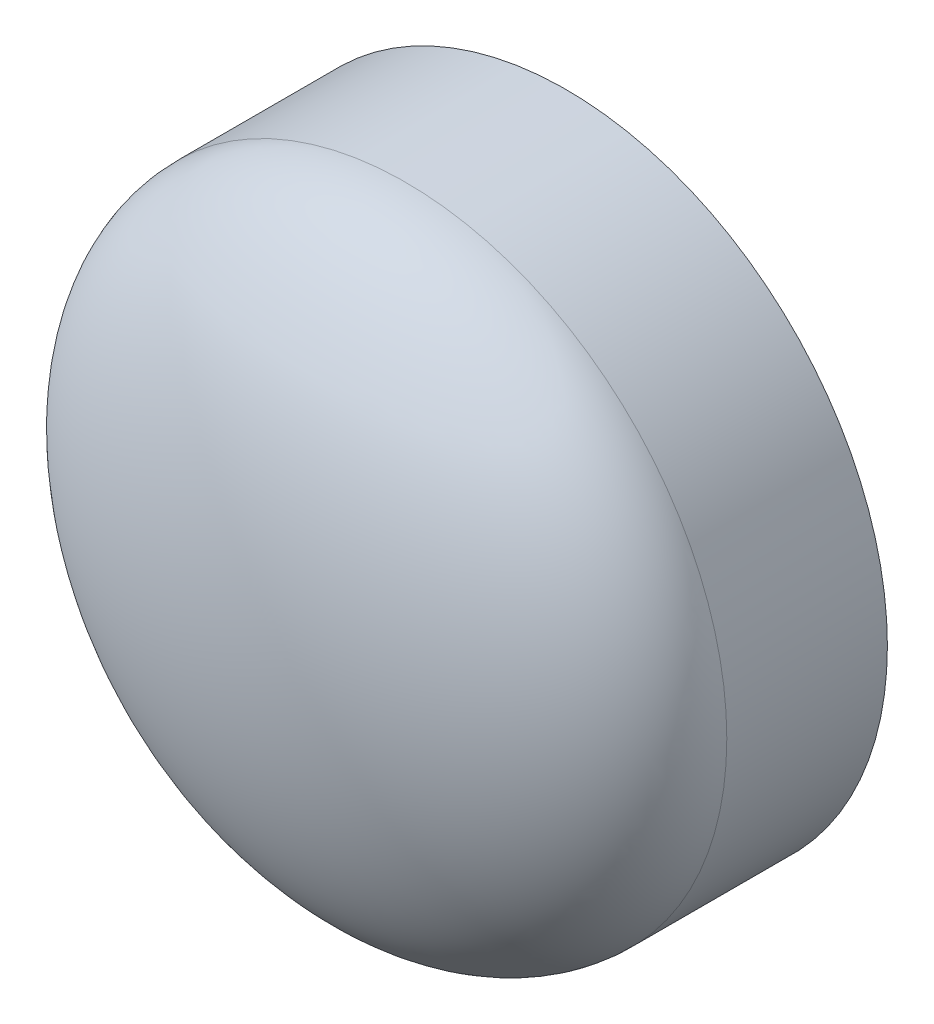
ISO-10303-21;
HEADER;
FILE_DESCRIPTION(('STEP AP214'),'2;1');
FILE_NAME('part.step','',(''),(''),'','','');
FILE_SCHEMA(('AUTOMOTIVE_DESIGN { 1 0 10303 214 1 1 1 1 }'));
ENDSEC;
DATA;
#1=APPLICATION_CONTEXT('core data for automotive mechanical design processes');
#2=APPLICATION_PROTOCOL_DEFINITION('international standard','automotive_design',2000,#1);
#3=PRODUCT_CONTEXT('',#1,'mechanical');
#4=PRODUCT('Part','Part','',(#3));
#5=PRODUCT_RELATED_PRODUCT_CATEGORY('part','',(#4));
#6=PRODUCT_DEFINITION_FORMATION('','',#4);
#7=PRODUCT_DEFINITION_CONTEXT('part definition',#1,'design');
#8=PRODUCT_DEFINITION('design','',#6,#7);
#9=PRODUCT_DEFINITION_SHAPE('','',#8);
#10=(LENGTH_UNIT() NAMED_UNIT(*) SI_UNIT(.MILLI.,.METRE.));
#11=(NAMED_UNIT(*) PLANE_ANGLE_UNIT() SI_UNIT($,.RADIAN.));
#12=(NAMED_UNIT(*) SI_UNIT($,.STERADIAN.) SOLID_ANGLE_UNIT());
#13=UNCERTAINTY_MEASURE_WITH_UNIT(LENGTH_MEASURE(1.E-05),#10,'distance_accuracy_value','');
#14=(GEOMETRIC_REPRESENTATION_CONTEXT(3) GLOBAL_UNCERTAINTY_ASSIGNED_CONTEXT((#13)) GLOBAL_UNIT_ASSIGNED_CONTEXT((#10,
#11,#12)) REPRESENTATION_CONTEXT('',''));
#15=CARTESIAN_POINT('',(0.,0.,0.));
#16=DIRECTION('',(0.,0.,1.));
#17=DIRECTION('',(1.,0.,0.));
#18=AXIS2_PLACEMENT_3D('',#15,#16,#17);
#19=CARTESIAN_POINT('',(0.,0.,0.79375));
#20=DIRECTION('',(0.,0.,-1.));
#21=DIRECTION('',(-1.,0.,0.));
#22=AXIS2_PLACEMENT_3D('',#19,#20,#21);
#23=CYLINDRICAL_SURFACE('',#22,1.5875);
#24=CARTESIAN_POINT('',(0.,0.,0.79375));
#25=DIRECTION('',(0.,0.,1.));
#26=DIRECTION('',(1.,0.,0.));
#27=AXIS2_PLACEMENT_3D('',#24,#25,#26);
#28=CIRCLE('',#27,1.5875);
#29=CARTESIAN_POINT('',(1.5875,0.,0.79375));
#30=VERTEX_POINT('',#29);
#31=EDGE_CURVE('E11',#30,#30,#28,.T.);
#32=ORIENTED_EDGE('',*,*,#31,.F.);
#33=EDGE_LOOP('',(#32));
#34=FACE_BOUND('',#33,.T.);
#35=CARTESIAN_POINT('',(0.,0.,0.));
#36=DIRECTION('',(0.,0.,1.));
#37=DIRECTION('',(1.,0.,0.));
#38=AXIS2_PLACEMENT_3D('',#35,#36,#37);
#39=CIRCLE('',#38,1.5875);
#40=CARTESIAN_POINT('',(1.5875,0.,0.));
#41=VERTEX_POINT('',#40);
#42=EDGE_CURVE('E41',#41,#41,#39,.T.);
#43=ORIENTED_EDGE('',*,*,#42,.T.);
#44=EDGE_LOOP('',(#43));
#45=FACE_BOUND('',#44,.T.);
#46=ADVANCED_FACE('F33',(#34,#45),#23,.T.);
#47=CARTESIAN_POINT('',(0.,0.,0.79375));
#48=DIRECTION('',(0.,1.,0.));
#49=DIRECTION('',(1.,0.,0.));
#50=AXIS2_PLACEMENT_3D('',#47,#48,#49);
#51=ELLIPSE('',#50,1.5875,0.79375);
#52=TRIMMED_CURVE('',#51,(PARAMETER_VALUE(4.71238898038469)),
(PARAMETER_VALUE(7.85398163397448)),.T.,.PARAMETER.);
#53=CARTESIAN_POINT('',(0.,0.,0.));
#54=DIRECTION('',(0.,0.,1.));
#55=AXIS1_PLACEMENT('',#53,#54);
#56=SURFACE_OF_REVOLUTION('',#52,#55);
#57=CARTESIAN_POINT('',(0.,0.,1.5875));
#58=VERTEX_POINT('',#57);
#59=VERTEX_LOOP('',#58);
#60=FACE_BOUND('',#59,.T.);
#61=ORIENTED_EDGE('',*,*,#31,.T.);
#62=EDGE_LOOP('',(#61));
#63=FACE_BOUND('',#62,.T.);
#64=ADVANCED_FACE('F35',(#60,#63),#56,.F.);
#65=CARTESIAN_POINT('',(0.,0.,0.));
#66=DIRECTION('',(0.,0.,1.));
#67=DIRECTION('',(1.,0.,0.));
#68=AXIS2_PLACEMENT_3D('',#65,#66,#67);
#69=PLANE('',#68);
#70=ORIENTED_EDGE('',*,*,#42,.F.);
#71=EDGE_LOOP('',(#70));
#72=FACE_BOUND('',#71,.T.);
#73=ADVANCED_FACE('F46',(#72),#69,.F.);
#74=CLOSED_SHELL('',(#46,#64,#73));
#75=MANIFOLD_SOLID_BREP('B2',#74);
#76=ADVANCED_BREP_SHAPE_REPRESENTATION('',(#18,#75),#14);
#77=SHAPE_DEFINITION_REPRESENTATION(#9,#76);
ENDSEC;
END-ISO-10303-21;
